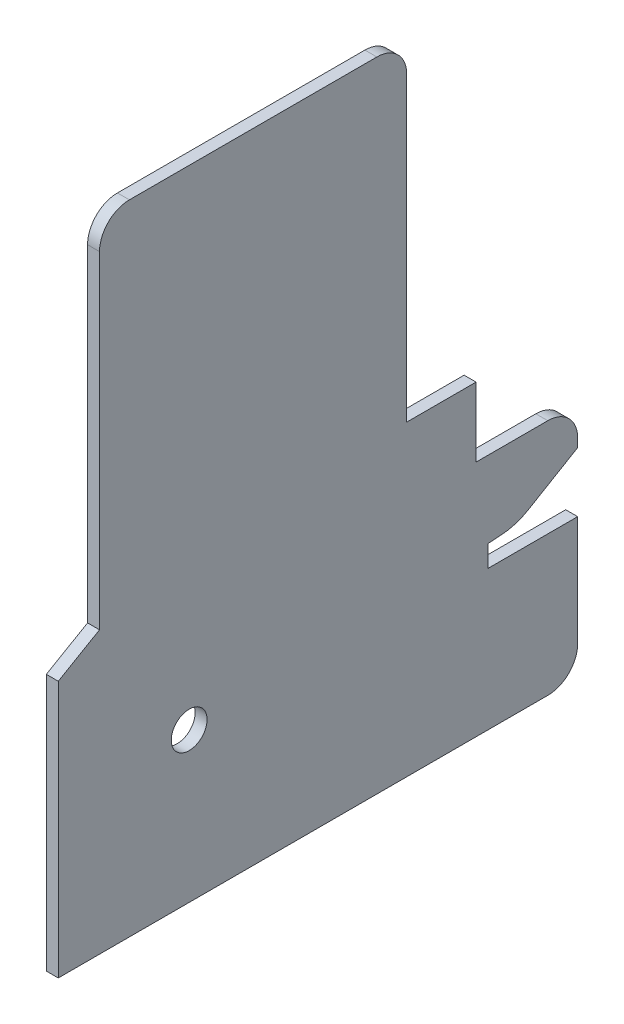
ISO-10303-21;
HEADER;
FILE_DESCRIPTION(('STEP AP214'),'2;1');
FILE_NAME('part.step','',(''),(''),'','','');
FILE_SCHEMA(('AUTOMOTIVE_DESIGN { 1 0 10303 214 1 1 1 1 }'));
ENDSEC;
DATA;
#1=APPLICATION_CONTEXT('core data for automotive mechanical design processes');
#2=APPLICATION_PROTOCOL_DEFINITION('international standard','automotive_design',2000,#1);
#3=PRODUCT_CONTEXT('',#1,'mechanical');
#4=PRODUCT('Part','Part','',(#3));
#5=PRODUCT_RELATED_PRODUCT_CATEGORY('part','',(#4));
#6=PRODUCT_DEFINITION_FORMATION('','',#4);
#7=PRODUCT_DEFINITION_CONTEXT('part definition',#1,'design');
#8=PRODUCT_DEFINITION('design','',#6,#7);
#9=PRODUCT_DEFINITION_SHAPE('','',#8);
#10=(LENGTH_UNIT() NAMED_UNIT(*) SI_UNIT(.MILLI.,.METRE.));
#11=(NAMED_UNIT(*) PLANE_ANGLE_UNIT() SI_UNIT($,.RADIAN.));
#12=(NAMED_UNIT(*) SI_UNIT($,.STERADIAN.) SOLID_ANGLE_UNIT());
#13=UNCERTAINTY_MEASURE_WITH_UNIT(LENGTH_MEASURE(1.E-05),#10,'distance_accuracy_value','');
#14=(GEOMETRIC_REPRESENTATION_CONTEXT(3) GLOBAL_UNCERTAINTY_ASSIGNED_CONTEXT((#13)) GLOBAL_UNIT_ASSIGNED_CONTEXT((#10,
#11,#12)) REPRESENTATION_CONTEXT('',''));
#15=CARTESIAN_POINT('',(0.,0.,0.));
#16=DIRECTION('',(0.,0.,1.));
#17=DIRECTION('',(1.,0.,0.));
#18=AXIS2_PLACEMENT_3D('',#15,#16,#17);
#19=CARTESIAN_POINT('',(-2.,23.4,0.));
#20=DIRECTION('',(0.,0.,-1.));
#21=DIRECTION('',(0.,1.,0.));
#22=AXIS2_PLACEMENT_3D('',#19,#20,#21);
#23=PLANE('',#22);
#24=DIRECTION('',(0.,1.,0.));
#25=VECTOR('',#24,1.);
#26=CARTESIAN_POINT('',(0.,23.4,0.));
#27=LINE('',#26,#25);
#28=CARTESIAN_POINT('',(0.,5.,0.));
#29=VERTEX_POINT('',#28);
#30=CARTESIAN_POINT('',(0.,23.4,0.));
#31=VERTEX_POINT('',#30);
#32=EDGE_CURVE('E229',#29,#31,#27,.T.);
#33=ORIENTED_EDGE('',*,*,#32,.F.);
#34=DIRECTION('',(1.,0.,0.));
#35=VECTOR('',#34,1.);
#36=CARTESIAN_POINT('',(-2.,5.,0.));
#37=LINE('',#36,#35);
#38=CARTESIAN_POINT('',(-2.,5.,0.));
#39=VERTEX_POINT('',#38);
#40=EDGE_CURVE('E173',#29,#39,#37,.F.);
#41=ORIENTED_EDGE('',*,*,#40,.T.);
#42=DIRECTION('',(0.,1.,0.));
#43=VECTOR('',#42,1.);
#44=CARTESIAN_POINT('',(-2.,23.4,0.));
#45=LINE('',#44,#43);
#46=CARTESIAN_POINT('',(-2.,23.4,0.));
#47=VERTEX_POINT('',#46);
#48=EDGE_CURVE('E167',#39,#47,#45,.T.);
#49=ORIENTED_EDGE('',*,*,#48,.T.);
#50=DIRECTION('',(1.,0.,0.));
#51=VECTOR('',#50,1.);
#52=CARTESIAN_POINT('',(-2.,23.4,0.));
#53=LINE('',#52,#51);
#54=EDGE_CURVE('E170',#47,#31,#53,.T.);
#55=ORIENTED_EDGE('',*,*,#54,.T.);
#56=EDGE_LOOP('',(#33,#41,#49,#55));
#57=FACE_BOUND('',#56,.T.);
#58=ADVANCED_FACE('F32',(#57),#23,.T.);
#59=CARTESIAN_POINT('',(-2.,0.,0.));
#60=DIRECTION('',(0.,-1.,0.));
#61=DIRECTION('',(0.,0.,-1.));
#62=AXIS2_PLACEMENT_3D('',#59,#60,#61);
#63=PLANE('',#62);
#64=DIRECTION('',(0.,0.,-1.));
#65=VECTOR('',#64,1.);
#66=CARTESIAN_POINT('',(-2.,0.,0.));
#67=LINE('',#66,#65);
#68=CARTESIAN_POINT('',(-2.,0.,86.9));
#69=VERTEX_POINT('',#68);
#70=CARTESIAN_POINT('',(-2.,0.,5.));
#71=VERTEX_POINT('',#70);
#72=EDGE_CURVE('E186',#69,#71,#67,.T.);
#73=ORIENTED_EDGE('',*,*,#72,.T.);
#74=DIRECTION('',(1.,0.,0.));
#75=VECTOR('',#74,1.);
#76=CARTESIAN_POINT('',(-2.,0.,5.));
#77=LINE('',#76,#75);
#78=CARTESIAN_POINT('',(0.,0.,5.));
#79=VERTEX_POINT('',#78);
#80=EDGE_CURVE('E269',#71,#79,#77,.T.);
#81=ORIENTED_EDGE('',*,*,#80,.T.);
#82=DIRECTION('',(0.,0.,-1.));
#83=VECTOR('',#82,1.);
#84=CARTESIAN_POINT('',(0.,0.,0.));
#85=LINE('',#84,#83);
#86=CARTESIAN_POINT('',(0.,0.,86.9));
#87=VERTEX_POINT('',#86);
#88=EDGE_CURVE('E178',#87,#79,#85,.T.);
#89=ORIENTED_EDGE('',*,*,#88,.F.);
#90=DIRECTION('',(1.,0.,0.));
#91=VECTOR('',#90,1.);
#92=CARTESIAN_POINT('',(-2.,0.,86.9));
#93=LINE('',#92,#91);
#94=EDGE_CURVE('E267',#69,#87,#93,.T.);
#95=ORIENTED_EDGE('',*,*,#94,.F.);
#96=EDGE_LOOP('',(#73,#81,#89,#95));
#97=FACE_BOUND('',#96,.T.);
#98=ADVANCED_FACE('F348',(#97),#63,.T.);
#99=CARTESIAN_POINT('',(-2.,0.,86.9));
#100=DIRECTION('',(0.,0.,1.));
#101=DIRECTION('',(1.,0.,0.));
#102=AXIS2_PLACEMENT_3D('',#99,#100,#101);
#103=PLANE('',#102);
#104=DIRECTION('',(0.,-1.,0.));
#105=VECTOR('',#104,1.);
#106=CARTESIAN_POINT('',(0.,0.,86.9));
#107=LINE('',#106,#105);
#108=CARTESIAN_POINT('',(0.,43.,86.9));
#109=VERTEX_POINT('',#108);
#110=EDGE_CURVE('E262',#109,#87,#107,.T.);
#111=ORIENTED_EDGE('',*,*,#110,.F.);
#112=DIRECTION('',(1.,0.,0.));
#113=VECTOR('',#112,1.);
#114=CARTESIAN_POINT('',(-2.,43.,86.9));
#115=LINE('',#114,#113);
#116=CARTESIAN_POINT('',(-2.,43.,86.9));
#117=VERTEX_POINT('',#116);
#118=EDGE_CURVE('E270',#117,#109,#115,.T.);
#119=ORIENTED_EDGE('',*,*,#118,.F.);
#120=DIRECTION('',(0.,-1.,0.));
#121=VECTOR('',#120,1.);
#122=CARTESIAN_POINT('',(-2.,0.,86.9));
#123=LINE('',#122,#121);
#124=EDGE_CURVE('E224',#117,#69,#123,.T.);
#125=ORIENTED_EDGE('',*,*,#124,.T.);
#126=ORIENTED_EDGE('',*,*,#94,.T.);
#127=EDGE_LOOP('',(#111,#119,#125,#126));
#128=FACE_BOUND('',#127,.T.);
#129=ADVANCED_FACE('F353',(#128),#103,.T.);
#130=CARTESIAN_POINT('',(-2.,43.,86.9));
#131=DIRECTION('',(0.,0.865140001465013,0.501530435631893));
#132=DIRECTION('',(0.,-0.501530435631893,0.865140001465013));
#133=AXIS2_PLACEMENT_3D('',#130,#131,#132);
#134=PLANE('',#133);
#135=DIRECTION('',(0.,-0.501530435631893,0.865140001465013));
#136=VECTOR('',#135,1.);
#137=CARTESIAN_POINT('',(0.,43.,86.9));
#138=LINE('',#137,#136);
#139=CARTESIAN_POINT('',(0.,47.,80.));
#140=VERTEX_POINT('',#139);
#141=EDGE_CURVE('E259',#140,#109,#138,.T.);
#142=ORIENTED_EDGE('',*,*,#141,.F.);
#143=DIRECTION('',(1.,0.,0.));
#144=VECTOR('',#143,1.);
#145=CARTESIAN_POINT('',(-2.,47.,80.));
#146=LINE('',#145,#144);
#147=CARTESIAN_POINT('',(-2.,47.,80.));
#148=VERTEX_POINT('',#147);
#149=EDGE_CURVE('E272',#148,#140,#146,.T.);
#150=ORIENTED_EDGE('',*,*,#149,.F.);
#151=DIRECTION('',(0.,-0.501530435631893,0.865140001465013));
#152=VECTOR('',#151,1.);
#153=CARTESIAN_POINT('',(-2.,43.,86.9));
#154=LINE('',#153,#152);
#155=EDGE_CURVE('E221',#148,#117,#154,.T.);
#156=ORIENTED_EDGE('',*,*,#155,.T.);
#157=ORIENTED_EDGE('',*,*,#118,.T.);
#158=EDGE_LOOP('',(#142,#150,#156,#157));
#159=FACE_BOUND('',#158,.T.);
#160=ADVANCED_FACE('F435',(#159),#134,.T.);
#161=CARTESIAN_POINT('',(-2.,47.,80.));
#162=DIRECTION('',(0.,0.,1.));
#163=DIRECTION('',(1.,0.,0.));
#164=AXIS2_PLACEMENT_3D('',#161,#162,#163);
#165=PLANE('',#164);
#166=DIRECTION('',(0.,-1.,0.));
#167=VECTOR('',#166,1.);
#168=CARTESIAN_POINT('',(0.,47.,80.));
#169=LINE('',#168,#167);
#170=CARTESIAN_POINT('',(0.,101.8,80.));
#171=VERTEX_POINT('',#170);
#172=EDGE_CURVE('E257',#171,#140,#169,.T.);
#173=ORIENTED_EDGE('',*,*,#172,.F.);
#174=DIRECTION('',(1.,0.,0.));
#175=VECTOR('',#174,1.);
#176=CARTESIAN_POINT('',(-2.,101.8,80.));
#177=LINE('',#176,#175);
#178=CARTESIAN_POINT('',(-2.,101.8,80.));
#179=VERTEX_POINT('',#178);
#180=EDGE_CURVE('E317',#171,#179,#177,.F.);
#181=ORIENTED_EDGE('',*,*,#180,.T.);
#182=DIRECTION('',(0.,-1.,0.));
#183=VECTOR('',#182,1.);
#184=CARTESIAN_POINT('',(-2.,47.,80.));
#185=LINE('',#184,#183);
#186=EDGE_CURVE('E219',#179,#148,#185,.T.);
#187=ORIENTED_EDGE('',*,*,#186,.T.);
#188=ORIENTED_EDGE('',*,*,#149,.T.);
#189=EDGE_LOOP('',(#173,#181,#187,#188));
#190=FACE_BOUND('',#189,.T.);
#191=ADVANCED_FACE('F439',(#190),#165,.T.);
#192=CARTESIAN_POINT('',(-2.,106.8,80.));
#193=DIRECTION('',(0.,1.,0.));
#194=DIRECTION('',(0.,0.,1.));
#195=AXIS2_PLACEMENT_3D('',#192,#193,#194);
#196=PLANE('',#195);
#197=DIRECTION('',(0.,0.,1.));
#198=VECTOR('',#197,1.);
#199=CARTESIAN_POINT('',(-2.,106.8,80.));
#200=LINE('',#199,#198);
#201=CARTESIAN_POINT('',(-2.,106.8,33.6));
#202=VERTEX_POINT('',#201);
#203=CARTESIAN_POINT('',(-2.,106.8,75.));
#204=VERTEX_POINT('',#203);
#205=EDGE_CURVE('E216',#202,#204,#200,.T.);
#206=ORIENTED_EDGE('',*,*,#205,.T.);
#207=DIRECTION('',(1.,0.,0.));
#208=VECTOR('',#207,1.);
#209=CARTESIAN_POINT('',(-2.,106.8,75.));
#210=LINE('',#209,#208);
#211=CARTESIAN_POINT('',(0.,106.8,75.));
#212=VERTEX_POINT('',#211);
#213=EDGE_CURVE('E314',#204,#212,#210,.T.);
#214=ORIENTED_EDGE('',*,*,#213,.T.);
#215=DIRECTION('',(0.,0.,1.));
#216=VECTOR('',#215,1.);
#217=CARTESIAN_POINT('',(0.,106.8,80.));
#218=LINE('',#217,#216);
#219=CARTESIAN_POINT('',(0.,106.8,33.6));
#220=VERTEX_POINT('',#219);
#221=EDGE_CURVE('E254',#220,#212,#218,.T.);
#222=ORIENTED_EDGE('',*,*,#221,.F.);
#223=DIRECTION('',(1.,0.,0.));
#224=VECTOR('',#223,1.);
#225=CARTESIAN_POINT('',(-2.,106.8,33.6));
#226=LINE('',#225,#224);
#227=EDGE_CURVE('E312',#220,#202,#226,.F.);
#228=ORIENTED_EDGE('',*,*,#227,.T.);
#229=EDGE_LOOP('',(#206,#214,#222,#228));
#230=FACE_BOUND('',#229,.T.);
#231=ADVANCED_FACE('F379',(#230),#196,.T.);
#232=CARTESIAN_POINT('',(-2.,106.8,28.6));
#233=DIRECTION('',(0.,0.,-1.));
#234=DIRECTION('',(0.,1.,0.));
#235=AXIS2_PLACEMENT_3D('',#232,#233,#234);
#236=PLANE('',#235);
#237=DIRECTION('',(0.,1.,0.));
#238=VECTOR('',#237,1.);
#239=CARTESIAN_POINT('',(-2.,106.8,28.6));
#240=LINE('',#239,#238);
#241=CARTESIAN_POINT('',(-2.,51.3960877582272,28.6));
#242=VERTEX_POINT('',#241);
#243=CARTESIAN_POINT('',(-2.,101.8,28.6));
#244=VERTEX_POINT('',#243);
#245=EDGE_CURVE('E213',#242,#244,#240,.T.);
#246=ORIENTED_EDGE('',*,*,#245,.T.);
#247=DIRECTION('',(1.,0.,0.));
#248=VECTOR('',#247,1.);
#249=CARTESIAN_POINT('',(-2.,101.8,28.6));
#250=LINE('',#249,#248);
#251=CARTESIAN_POINT('',(0.,101.8,28.6));
#252=VERTEX_POINT('',#251);
#253=EDGE_CURVE('E319',#244,#252,#250,.T.);
#254=ORIENTED_EDGE('',*,*,#253,.T.);
#255=DIRECTION('',(0.,1.,0.));
#256=VECTOR('',#255,1.);
#257=CARTESIAN_POINT('',(0.,106.8,28.6));
#258=LINE('',#257,#256);
#259=CARTESIAN_POINT('',(0.,51.3960877582272,28.6));
#260=VERTEX_POINT('',#259);
#261=EDGE_CURVE('E251',#260,#252,#258,.T.);
#262=ORIENTED_EDGE('',*,*,#261,.F.);
#263=DIRECTION('',(1.,0.,0.));
#264=VECTOR('',#263,1.);
#265=CARTESIAN_POINT('',(-2.,51.3960877582272,28.6));
#266=LINE('',#265,#264);
#267=EDGE_CURVE('E275',#242,#260,#266,.T.);
#268=ORIENTED_EDGE('',*,*,#267,.F.);
#269=EDGE_LOOP('',(#246,#254,#262,#268));
#270=FACE_BOUND('',#269,.T.);
#271=ADVANCED_FACE('F386',(#270),#236,.T.);
#272=CARTESIAN_POINT('',(-2.,51.3960877582272,28.6));
#273=DIRECTION('',(0.,1.,0.));
#274=DIRECTION('',(0.,0.,1.));
#275=AXIS2_PLACEMENT_3D('',#272,#273,#274);
#276=PLANE('',#275);
#277=DIRECTION('',(0.,0.,1.));
#278=VECTOR('',#277,1.);
#279=CARTESIAN_POINT('',(0.,51.3960877582272,28.6));
#280=LINE('',#279,#278);
#281=CARTESIAN_POINT('',(0.,51.3960877582272,17.));
#282=VERTEX_POINT('',#281);
#283=EDGE_CURVE('E248',#282,#260,#280,.T.);
#284=ORIENTED_EDGE('',*,*,#283,.F.);
#285=DIRECTION('',(1.,0.,0.));
#286=VECTOR('',#285,1.);
#287=CARTESIAN_POINT('',(-2.,51.3960877582272,17.));
#288=LINE('',#287,#286);
#289=CARTESIAN_POINT('',(-2.,51.3960877582272,17.));
#290=VERTEX_POINT('',#289);
#291=EDGE_CURVE('E277',#290,#282,#288,.T.);
#292=ORIENTED_EDGE('',*,*,#291,.F.);
#293=DIRECTION('',(0.,0.,1.));
#294=VECTOR('',#293,1.);
#295=CARTESIAN_POINT('',(-2.,51.3960877582272,28.6));
#296=LINE('',#295,#294);
#297=EDGE_CURVE('E210',#290,#242,#296,.T.);
#298=ORIENTED_EDGE('',*,*,#297,.T.);
#299=ORIENTED_EDGE('',*,*,#267,.T.);
#300=EDGE_LOOP('',(#284,#292,#298,#299));
#301=FACE_BOUND('',#300,.T.);
#302=ADVANCED_FACE('F390',(#301),#276,.T.);
#303=CARTESIAN_POINT('',(-2.,51.3960877582272,17.));
#304=DIRECTION('',(0.,0.,-1.));
#305=DIRECTION('',(-1.,0.,0.));
#306=AXIS2_PLACEMENT_3D('',#303,#304,#305);
#307=PLANE('',#306);
#308=DIRECTION('',(0.,1.,0.));
#309=VECTOR('',#308,1.);
#310=CARTESIAN_POINT('',(0.,51.3960877582272,17.));
#311=LINE('',#310,#309);
#312=CARTESIAN_POINT('',(0.,39.8,17.));
#313=VERTEX_POINT('',#312);
#314=EDGE_CURVE('E245',#313,#282,#311,.T.);
#315=ORIENTED_EDGE('',*,*,#314,.F.);
#316=DIRECTION('',(1.,0.,0.));
#317=VECTOR('',#316,1.);
#318=CARTESIAN_POINT('',(-2.,39.8,17.));
#319=LINE('',#318,#317);
#320=CARTESIAN_POINT('',(-2.,39.8,17.));
#321=VERTEX_POINT('',#320);
#322=EDGE_CURVE('E279',#321,#313,#319,.T.);
#323=ORIENTED_EDGE('',*,*,#322,.F.);
#324=DIRECTION('',(0.,1.,0.));
#325=VECTOR('',#324,1.);
#326=CARTESIAN_POINT('',(-2.,51.3960877582272,17.));
#327=LINE('',#326,#325);
#328=EDGE_CURVE('E207',#321,#290,#327,.T.);
#329=ORIENTED_EDGE('',*,*,#328,.T.);
#330=ORIENTED_EDGE('',*,*,#291,.T.);
#331=EDGE_LOOP('',(#315,#323,#329,#330));
#332=FACE_BOUND('',#331,.T.);
#333=ADVANCED_FACE('F396',(#332),#307,.T.);
#334=CARTESIAN_POINT('',(-2.,39.8,17.));
#335=DIRECTION('',(0.,1.,0.));
#336=DIRECTION('',(0.,0.,1.));
#337=AXIS2_PLACEMENT_3D('',#334,#335,#336);
#338=PLANE('',#337);
#339=DIRECTION('',(0.,0.,1.));
#340=VECTOR('',#339,1.);
#341=CARTESIAN_POINT('',(0.,39.8,17.));
#342=LINE('',#341,#340);
#343=CARTESIAN_POINT('',(0.,39.8,5.));
#344=VERTEX_POINT('',#343);
#345=EDGE_CURVE('E243',#344,#313,#342,.T.);
#346=ORIENTED_EDGE('',*,*,#345,.F.);
#347=DIRECTION('',(1.,0.,0.));
#348=VECTOR('',#347,1.);
#349=CARTESIAN_POINT('',(-2.,39.8,5.));
#350=LINE('',#349,#348);
#351=CARTESIAN_POINT('',(-2.,39.8,5.));
#352=VERTEX_POINT('',#351);
#353=EDGE_CURVE('E310',#344,#352,#350,.F.);
#354=ORIENTED_EDGE('',*,*,#353,.T.);
#355=DIRECTION('',(0.,0.,1.));
#356=VECTOR('',#355,1.);
#357=CARTESIAN_POINT('',(-2.,39.8,17.));
#358=LINE('',#357,#356);
#359=EDGE_CURVE('E205',#352,#321,#358,.T.);
#360=ORIENTED_EDGE('',*,*,#359,.T.);
#361=ORIENTED_EDGE('',*,*,#322,.T.);
#362=EDGE_LOOP('',(#346,#354,#360,#361));
#363=FACE_BOUND('',#362,.T.);
#364=ADVANCED_FACE('F399',(#363),#338,.T.);
#365=CARTESIAN_POINT('',(-2.,39.8,0.));
#366=DIRECTION('',(0.,0.,-1.));
#367=DIRECTION('',(0.,1.,0.));
#368=AXIS2_PLACEMENT_3D('',#365,#366,#367);
#369=PLANE('',#368);
#370=DIRECTION('',(0.,1.,0.));
#371=VECTOR('',#370,1.);
#372=CARTESIAN_POINT('',(-2.,39.8,0.));
#373=LINE('',#372,#371);
#374=CARTESIAN_POINT('',(-2.,33.4,0.));
#375=VERTEX_POINT('',#374);
#376=CARTESIAN_POINT('',(-2.,34.8,0.));
#377=VERTEX_POINT('',#376);
#378=EDGE_CURVE('E202',#375,#377,#373,.T.);
#379=ORIENTED_EDGE('',*,*,#378,.T.);
#380=DIRECTION('',(1.,0.,0.));
#381=VECTOR('',#380,1.);
#382=CARTESIAN_POINT('',(-2.,34.8,0.));
#383=LINE('',#382,#381);
#384=CARTESIAN_POINT('',(0.,34.8,0.));
#385=VERTEX_POINT('',#384);
#386=EDGE_CURVE('E307',#377,#385,#383,.T.);
#387=ORIENTED_EDGE('',*,*,#386,.T.);
#388=DIRECTION('',(0.,1.,0.));
#389=VECTOR('',#388,1.);
#390=CARTESIAN_POINT('',(0.,39.8,0.));
#391=LINE('',#390,#389);
#392=CARTESIAN_POINT('',(0.,33.4,0.));
#393=VERTEX_POINT('',#392);
#394=EDGE_CURVE('E240',#393,#385,#391,.T.);
#395=ORIENTED_EDGE('',*,*,#394,.F.);
#396=DIRECTION('',(1.,0.,0.));
#397=VECTOR('',#396,1.);
#398=CARTESIAN_POINT('',(-2.,33.4,0.));
#399=LINE('',#398,#397);
#400=EDGE_CURVE('E282',#375,#393,#399,.T.);
#401=ORIENTED_EDGE('',*,*,#400,.F.);
#402=EDGE_LOOP('',(#379,#387,#395,#401));
#403=FACE_BOUND('',#402,.T.);
#404=ADVANCED_FACE('F405',(#403),#369,.T.);
#405=CARTESIAN_POINT('',(-2.,33.4,0.));
#406=DIRECTION('',(0.,-0.861160392855026,-0.508333333333333));
#407=DIRECTION('',(0.,0.508333333333333,-0.861160392855026));
#408=AXIS2_PLACEMENT_3D('',#405,#406,#407);
#409=PLANE('',#408);
#410=DIRECTION('',(0.,0.508333333333333,-0.861160392855026));
#411=VECTOR('',#410,1.);
#412=CARTESIAN_POINT('',(0.,33.4,0.));
#413=LINE('',#412,#411);
#414=CARTESIAN_POINT('',(0.,28.5144984934904,8.27645979666813));
#415=VERTEX_POINT('',#414);
#416=EDGE_CURVE('E238',#415,#393,#413,.T.);
#417=ORIENTED_EDGE('',*,*,#416,.F.);
#418=DIRECTION('',(1.,0.,0.));
#419=VECTOR('',#418,1.);
#420=CARTESIAN_POINT('',(-2.,28.5144984934904,8.27645979666813));
#421=LINE('',#420,#419);
#422=CARTESIAN_POINT('',(-2.,28.5144984934904,8.27645979666813));
#423=VERTEX_POINT('',#422);
#424=EDGE_CURVE('E40',#415,#423,#421,.F.);
#425=ORIENTED_EDGE('',*,*,#424,.T.);
#426=DIRECTION('',(0.,0.508333333333333,-0.861160392855026));
#427=VECTOR('',#426,1.);
#428=CARTESIAN_POINT('',(-2.,33.4,0.));
#429=LINE('',#428,#427);
#430=EDGE_CURVE('E200',#423,#375,#429,.T.);
#431=ORIENTED_EDGE('',*,*,#430,.T.);
#432=ORIENTED_EDGE('',*,*,#400,.T.);
#433=EDGE_LOOP('',(#417,#425,#431,#432));
#434=FACE_BOUND('',#433,.T.);
#435=ADVANCED_FACE('F407',(#434),#409,.T.);
#436=CARTESIAN_POINT('',(-2.,27.3,10.3339247142603));
#437=DIRECTION('',(0.,-0.997939535473227,-0.0641613866704918));
#438=DIRECTION('',(0.,0.0641613866704918,-0.997939535473227));
#439=AXIS2_PLACEMENT_3D('',#436,#437,#438);
#440=PLANE('',#439);
#441=DIRECTION('',(0.,0.0641613866704918,-0.997939535473227));
#442=VECTOR('',#441,1.);
#443=CARTESIAN_POINT('',(-2.,27.3,10.3339247142603));
#444=LINE('',#443,#442);
#445=CARTESIAN_POINT('',(-2.,27.,15.));
#446=VERTEX_POINT('',#445);
#447=CARTESIAN_POINT('',(-2.,27.1467070673084,12.7181792632965));
#448=VERTEX_POINT('',#447);
#449=EDGE_CURVE('E194',#446,#448,#444,.T.);
#450=ORIENTED_EDGE('',*,*,#449,.T.);
#451=DIRECTION('',(1.,0.,0.));
#452=VECTOR('',#451,1.);
#453=CARTESIAN_POINT('',(-2.,27.1467070673084,12.7181792632965));
#454=LINE('',#453,#452);
#455=CARTESIAN_POINT('',(0.,27.1467070673084,12.7181792632965));
#456=VERTEX_POINT('',#455);
#457=EDGE_CURVE('E322',#448,#456,#454,.T.);
#458=ORIENTED_EDGE('',*,*,#457,.T.);
#459=DIRECTION('',(0.,0.0641613866704918,-0.997939535473227));
#460=VECTOR('',#459,1.);
#461=CARTESIAN_POINT('',(0.,27.3,10.3339247142603));
#462=LINE('',#461,#460);
#463=CARTESIAN_POINT('',(0.,27.,15.));
#464=VERTEX_POINT('',#463);
#465=EDGE_CURVE('E236',#464,#456,#462,.T.);
#466=ORIENTED_EDGE('',*,*,#465,.F.);
#467=DIRECTION('',(1.,0.,0.));
#468=VECTOR('',#467,1.);
#469=CARTESIAN_POINT('',(-2.,27.,15.));
#470=LINE('',#469,#468);
#471=EDGE_CURVE('E285',#446,#464,#470,.T.);
#472=ORIENTED_EDGE('',*,*,#471,.F.);
#473=EDGE_LOOP('',(#450,#458,#466,#472));
#474=FACE_BOUND('',#473,.T.);
#475=ADVANCED_FACE('F328',(#474),#440,.T.);
#476=CARTESIAN_POINT('',(-2.,27.,15.));
#477=DIRECTION('',(0.,0.,-1.));
#478=DIRECTION('',(0.,1.,0.));
#479=AXIS2_PLACEMENT_3D('',#476,#477,#478);
#480=PLANE('',#479);
#481=DIRECTION('',(0.,1.,0.));
#482=VECTOR('',#481,1.);
#483=CARTESIAN_POINT('',(0.,27.,15.));
#484=LINE('',#483,#482);
#485=CARTESIAN_POINT('',(0.,23.4,15.));
#486=VERTEX_POINT('',#485);
#487=EDGE_CURVE('E233',#486,#464,#484,.T.);
#488=ORIENTED_EDGE('',*,*,#487,.F.);
#489=DIRECTION('',(1.,0.,0.));
#490=VECTOR('',#489,1.);
#491=CARTESIAN_POINT('',(-2.,23.4,15.));
#492=LINE('',#491,#490);
#493=CARTESIAN_POINT('',(-2.,23.4,15.));
#494=VERTEX_POINT('',#493);
#495=EDGE_CURVE('E185',#494,#486,#492,.T.);
#496=ORIENTED_EDGE('',*,*,#495,.F.);
#497=DIRECTION('',(0.,1.,0.));
#498=VECTOR('',#497,1.);
#499=CARTESIAN_POINT('',(-2.,27.,15.));
#500=LINE('',#499,#498);
#501=EDGE_CURVE('E192',#494,#446,#500,.T.);
#502=ORIENTED_EDGE('',*,*,#501,.T.);
#503=ORIENTED_EDGE('',*,*,#471,.T.);
#504=EDGE_LOOP('',(#488,#496,#502,#503));
#505=FACE_BOUND('',#504,.T.);
#506=ADVANCED_FACE('F334',(#505),#480,.T.);
#507=CARTESIAN_POINT('',(-2.,23.4,15.));
#508=DIRECTION('',(0.,1.,0.));
#509=DIRECTION('',(0.,0.,1.));
#510=AXIS2_PLACEMENT_3D('',#507,#508,#509);
#511=PLANE('',#510);
#512=DIRECTION('',(0.,0.,1.));
#513=VECTOR('',#512,1.);
#514=CARTESIAN_POINT('',(0.,23.4,15.));
#515=LINE('',#514,#513);
#516=EDGE_CURVE('E184',#31,#486,#515,.T.);
#517=ORIENTED_EDGE('',*,*,#516,.F.);
#518=ORIENTED_EDGE('',*,*,#54,.F.);
#519=DIRECTION('',(0.,0.,1.));
#520=VECTOR('',#519,1.);
#521=CARTESIAN_POINT('',(-2.,23.4,15.));
#522=LINE('',#521,#520);
#523=EDGE_CURVE('E177',#47,#494,#522,.T.);
#524=ORIENTED_EDGE('',*,*,#523,.T.);
#525=ORIENTED_EDGE('',*,*,#495,.T.);
#526=EDGE_LOOP('',(#517,#518,#524,#525));
#527=FACE_BOUND('',#526,.T.);
#528=ADVANCED_FACE('F182',(#527),#511,.T.);
#529=CARTESIAN_POINT('',(-2.,0.,0.));
#530=DIRECTION('',(-1.,0.,0.));
#531=DIRECTION('',(0.,0.,1.));
#532=AXIS2_PLACEMENT_3D('',#529,#530,#531);
#533=PLANE('',#532);
#534=CARTESIAN_POINT('',(-2.,25.,65.));
#535=DIRECTION('',(-1.,0.,0.));
#536=DIRECTION('',(0.,0.,1.));
#537=AXIS2_PLACEMENT_3D('',#534,#535,#536);
#538=CIRCLE('',#537,3.00000000000001);
#539=CARTESIAN_POINT('',(-2.,25.,68.));
#540=VERTEX_POINT('',#539);
#541=EDGE_CURVE('E231',#540,#540,#538,.F.);
#542=ORIENTED_EDGE('',*,*,#541,.T.);
#543=EDGE_LOOP('',(#542));
#544=FACE_BOUND('',#543,.T.);
#545=ORIENTED_EDGE('',*,*,#430,.F.);
#546=CARTESIAN_POINT('',(-2.,37.1261024220407,13.3597931300015));
#547=DIRECTION('',(-1.,0.,0.));
#548=DIRECTION('',(0.,0.,1.));
#549=AXIS2_PLACEMENT_3D('',#546,#547,#548);
#550=CIRCLE('',#549,10.);
#551=EDGE_CURVE('E11',#423,#448,#550,.T.);
#552=ORIENTED_EDGE('',*,*,#551,.T.);
#553=ORIENTED_EDGE('',*,*,#449,.F.);
#554=ORIENTED_EDGE('',*,*,#501,.F.);
#555=ORIENTED_EDGE('',*,*,#523,.F.);
#556=ORIENTED_EDGE('',*,*,#48,.F.);
#557=CARTESIAN_POINT('',(-2.,5.,5.));
#558=DIRECTION('',(-1.,0.,0.));
#559=DIRECTION('',(0.,0.,1.));
#560=AXIS2_PLACEMENT_3D('',#557,#558,#559);
#561=CIRCLE('',#560,5.);
#562=EDGE_CURVE('E305',#39,#71,#561,.T.);
#563=ORIENTED_EDGE('',*,*,#562,.T.);
#564=ORIENTED_EDGE('',*,*,#72,.F.);
#565=ORIENTED_EDGE('',*,*,#124,.F.);
#566=ORIENTED_EDGE('',*,*,#155,.F.);
#567=ORIENTED_EDGE('',*,*,#186,.F.);
#568=CARTESIAN_POINT('',(-2.,101.8,75.));
#569=DIRECTION('',(-1.,0.,0.));
#570=DIRECTION('',(0.,0.,1.));
#571=AXIS2_PLACEMENT_3D('',#568,#569,#570);
#572=CIRCLE('',#571,5.);
#573=EDGE_CURVE('E301',#179,#204,#572,.T.);
#574=ORIENTED_EDGE('',*,*,#573,.T.);
#575=ORIENTED_EDGE('',*,*,#205,.F.);
#576=CARTESIAN_POINT('',(-2.,101.8,33.6));
#577=DIRECTION('',(-1.,0.,0.));
#578=DIRECTION('',(0.,0.,1.));
#579=AXIS2_PLACEMENT_3D('',#576,#577,#578);
#580=CIRCLE('',#579,5.);
#581=EDGE_CURVE('E299',#202,#244,#580,.T.);
#582=ORIENTED_EDGE('',*,*,#581,.T.);
#583=ORIENTED_EDGE('',*,*,#245,.F.);
#584=ORIENTED_EDGE('',*,*,#297,.F.);
#585=ORIENTED_EDGE('',*,*,#328,.F.);
#586=ORIENTED_EDGE('',*,*,#359,.F.);
#587=CARTESIAN_POINT('',(-2.,34.8,5.));
#588=DIRECTION('',(-1.,0.,0.));
#589=DIRECTION('',(0.,0.,1.));
#590=AXIS2_PLACEMENT_3D('',#587,#588,#589);
#591=CIRCLE('',#590,5.);
#592=EDGE_CURVE('E303',#352,#377,#591,.T.);
#593=ORIENTED_EDGE('',*,*,#592,.T.);
#594=ORIENTED_EDGE('',*,*,#378,.F.);
#595=EDGE_LOOP('',(#545,#552,#553,#554,#555,#556,#563,#564,#565,#566,#567,#574,#575,#582,#583,
#584,#585,#586,#593,#594));
#596=FACE_BOUND('',#595,.T.);
#597=ADVANCED_FACE('F189',(#544,#596),#533,.T.);
#598=CARTESIAN_POINT('',(0.,0.,0.));
#599=DIRECTION('',(-1.,0.,0.));
#600=DIRECTION('',(0.,0.,1.));
#601=AXIS2_PLACEMENT_3D('',#598,#599,#600);
#602=PLANE('',#601);
#603=CARTESIAN_POINT('',(0.,25.,65.));
#604=DIRECTION('',(1.,0.,0.));
#605=DIRECTION('',(0.,0.,-1.));
#606=AXIS2_PLACEMENT_3D('',#603,#604,#605);
#607=CIRCLE('',#606,3.00000000000001);
#608=CARTESIAN_POINT('',(0.,25.,62.));
#609=VERTEX_POINT('',#608);
#610=EDGE_CURVE('E586',#609,#609,#607,.T.);
#611=ORIENTED_EDGE('',*,*,#610,.F.);
#612=EDGE_LOOP('',(#611));
#613=FACE_BOUND('',#612,.T.);
#614=ORIENTED_EDGE('',*,*,#465,.T.);
#615=CARTESIAN_POINT('',(0.,37.1261024220407,13.3597931300015));
#616=DIRECTION('',(-1.,0.,0.));
#617=DIRECTION('',(0.,0.,1.));
#618=AXIS2_PLACEMENT_3D('',#615,#616,#617);
#619=CIRCLE('',#618,10.);
#620=EDGE_CURVE('E54',#456,#415,#619,.F.);
#621=ORIENTED_EDGE('',*,*,#620,.T.);
#622=ORIENTED_EDGE('',*,*,#416,.T.);
#623=ORIENTED_EDGE('',*,*,#394,.T.);
#624=CARTESIAN_POINT('',(0.,34.8,5.));
#625=DIRECTION('',(-1.,0.,0.));
#626=DIRECTION('',(0.,0.,1.));
#627=AXIS2_PLACEMENT_3D('',#624,#625,#626);
#628=CIRCLE('',#627,5.);
#629=EDGE_CURVE('E294',#385,#344,#628,.F.);
#630=ORIENTED_EDGE('',*,*,#629,.T.);
#631=ORIENTED_EDGE('',*,*,#345,.T.);
#632=ORIENTED_EDGE('',*,*,#314,.T.);
#633=ORIENTED_EDGE('',*,*,#283,.T.);
#634=ORIENTED_EDGE('',*,*,#261,.T.);
#635=CARTESIAN_POINT('',(0.,101.8,33.6));
#636=DIRECTION('',(-1.,0.,0.));
#637=DIRECTION('',(0.,0.,1.));
#638=AXIS2_PLACEMENT_3D('',#635,#636,#637);
#639=CIRCLE('',#638,5.);
#640=EDGE_CURVE('E290',#252,#220,#639,.F.);
#641=ORIENTED_EDGE('',*,*,#640,.T.);
#642=ORIENTED_EDGE('',*,*,#221,.T.);
#643=CARTESIAN_POINT('',(0.,101.8,75.));
#644=DIRECTION('',(-1.,0.,0.));
#645=DIRECTION('',(0.,0.,1.));
#646=AXIS2_PLACEMENT_3D('',#643,#644,#645);
#647=CIRCLE('',#646,5.);
#648=EDGE_CURVE('E292',#212,#171,#647,.F.);
#649=ORIENTED_EDGE('',*,*,#648,.T.);
#650=ORIENTED_EDGE('',*,*,#172,.T.);
#651=ORIENTED_EDGE('',*,*,#141,.T.);
#652=ORIENTED_EDGE('',*,*,#110,.T.);
#653=ORIENTED_EDGE('',*,*,#88,.T.);
#654=CARTESIAN_POINT('',(0.,5.,5.));
#655=DIRECTION('',(-1.,0.,0.));
#656=DIRECTION('',(0.,0.,1.));
#657=AXIS2_PLACEMENT_3D('',#654,#655,#656);
#658=CIRCLE('',#657,5.);
#659=EDGE_CURVE('E296',#79,#29,#658,.F.);
#660=ORIENTED_EDGE('',*,*,#659,.T.);
#661=ORIENTED_EDGE('',*,*,#32,.T.);
#662=ORIENTED_EDGE('',*,*,#516,.T.);
#663=ORIENTED_EDGE('',*,*,#487,.T.);
#664=EDGE_LOOP('',(#614,#621,#622,#623,#630,#631,#632,#633,#634,#641,#642,#649,#650,#651,#652,
#653,#660,#661,#662,#663));
#665=FACE_BOUND('',#664,.T.);
#666=ADVANCED_FACE('F331',(#613,#665),#602,.F.);
#667=CARTESIAN_POINT('',(-2.,5.,5.));
#668=DIRECTION('',(1.,0.,0.));
#669=DIRECTION('',(0.,0.,-1.));
#670=AXIS2_PLACEMENT_3D('',#667,#668,#669);
#671=CYLINDRICAL_SURFACE('',#670,5.);
#672=ORIENTED_EDGE('',*,*,#562,.F.);
#673=ORIENTED_EDGE('',*,*,#40,.F.);
#674=ORIENTED_EDGE('',*,*,#659,.F.);
#675=ORIENTED_EDGE('',*,*,#80,.F.);
#676=EDGE_LOOP('',(#672,#673,#674,#675));
#677=FACE_BOUND('',#676,.T.);
#678=ADVANCED_FACE('F359',(#677),#671,.T.);
#679=CARTESIAN_POINT('',(-2.,34.8,5.));
#680=DIRECTION('',(1.,0.,0.));
#681=DIRECTION('',(0.,0.,-1.));
#682=AXIS2_PLACEMENT_3D('',#679,#680,#681);
#683=CYLINDRICAL_SURFACE('',#682,5.);
#684=ORIENTED_EDGE('',*,*,#592,.F.);
#685=ORIENTED_EDGE('',*,*,#353,.F.);
#686=ORIENTED_EDGE('',*,*,#629,.F.);
#687=ORIENTED_EDGE('',*,*,#386,.F.);
#688=EDGE_LOOP('',(#684,#685,#686,#687));
#689=FACE_BOUND('',#688,.T.);
#690=ADVANCED_FACE('F362',(#689),#683,.T.);
#691=CARTESIAN_POINT('',(-2.,101.8,75.));
#692=DIRECTION('',(1.,0.,0.));
#693=DIRECTION('',(0.,0.,-1.));
#694=AXIS2_PLACEMENT_3D('',#691,#692,#693);
#695=CYLINDRICAL_SURFACE('',#694,5.);
#696=ORIENTED_EDGE('',*,*,#573,.F.);
#697=ORIENTED_EDGE('',*,*,#180,.F.);
#698=ORIENTED_EDGE('',*,*,#648,.F.);
#699=ORIENTED_EDGE('',*,*,#213,.F.);
#700=EDGE_LOOP('',(#696,#697,#698,#699));
#701=FACE_BOUND('',#700,.T.);
#702=ADVANCED_FACE('F345',(#701),#695,.T.);
#703=CARTESIAN_POINT('',(-2.,101.8,33.6));
#704=DIRECTION('',(1.,0.,0.));
#705=DIRECTION('',(0.,0.,-1.));
#706=AXIS2_PLACEMENT_3D('',#703,#704,#705);
#707=CYLINDRICAL_SURFACE('',#706,5.);
#708=ORIENTED_EDGE('',*,*,#581,.F.);
#709=ORIENTED_EDGE('',*,*,#227,.F.);
#710=ORIENTED_EDGE('',*,*,#640,.F.);
#711=ORIENTED_EDGE('',*,*,#253,.F.);
#712=EDGE_LOOP('',(#708,#709,#710,#711));
#713=FACE_BOUND('',#712,.T.);
#714=ADVANCED_FACE('F338',(#713),#707,.T.);
#715=CARTESIAN_POINT('',(-2.,37.1261024220407,13.3597931300015));
#716=DIRECTION('',(1.,0.,0.));
#717=DIRECTION('',(0.,0.,-1.));
#718=AXIS2_PLACEMENT_3D('',#715,#716,#717);
#719=CYLINDRICAL_SURFACE('',#718,10.);
#720=ORIENTED_EDGE('',*,*,#551,.F.);
#721=ORIENTED_EDGE('',*,*,#424,.F.);
#722=ORIENTED_EDGE('',*,*,#620,.F.);
#723=ORIENTED_EDGE('',*,*,#457,.F.);
#724=EDGE_LOOP('',(#720,#721,#722,#723));
#725=FACE_BOUND('',#724,.T.);
#726=ADVANCED_FACE('F34',(#725),#719,.T.);
#727=CARTESIAN_POINT('',(-10.4852813742386,25.,65.));
#728=DIRECTION('',(1.,0.,0.));
#729=DIRECTION('',(0.,0.,-1.));
#730=AXIS2_PLACEMENT_3D('',#727,#728,#729);
#731=CYLINDRICAL_SURFACE('',#730,3.00000000000001);
#732=ORIENTED_EDGE('',*,*,#610,.T.);
#733=EDGE_LOOP('',(#732));
#734=FACE_BOUND('',#733,.T.);
#735=ORIENTED_EDGE('',*,*,#541,.F.);
#736=EDGE_LOOP('',(#735));
#737=FACE_BOUND('',#736,.T.);
#738=ADVANCED_FACE('F337',(#734,#737),#731,.F.);
#739=CLOSED_SHELL('',(#58,#98,#129,#160,#191,#231,#271,#302,#333,#364,#404,#435,#475,#506,#528,
#597,#666,#678,#690,#702,#714,#726,#738));
#740=MANIFOLD_SOLID_BREP('B2',#739);
#741=ADVANCED_BREP_SHAPE_REPRESENTATION('',(#18,#740),#14);
#742=SHAPE_DEFINITION_REPRESENTATION(#9,#741);
ENDSEC;
END-ISO-10303-21;
